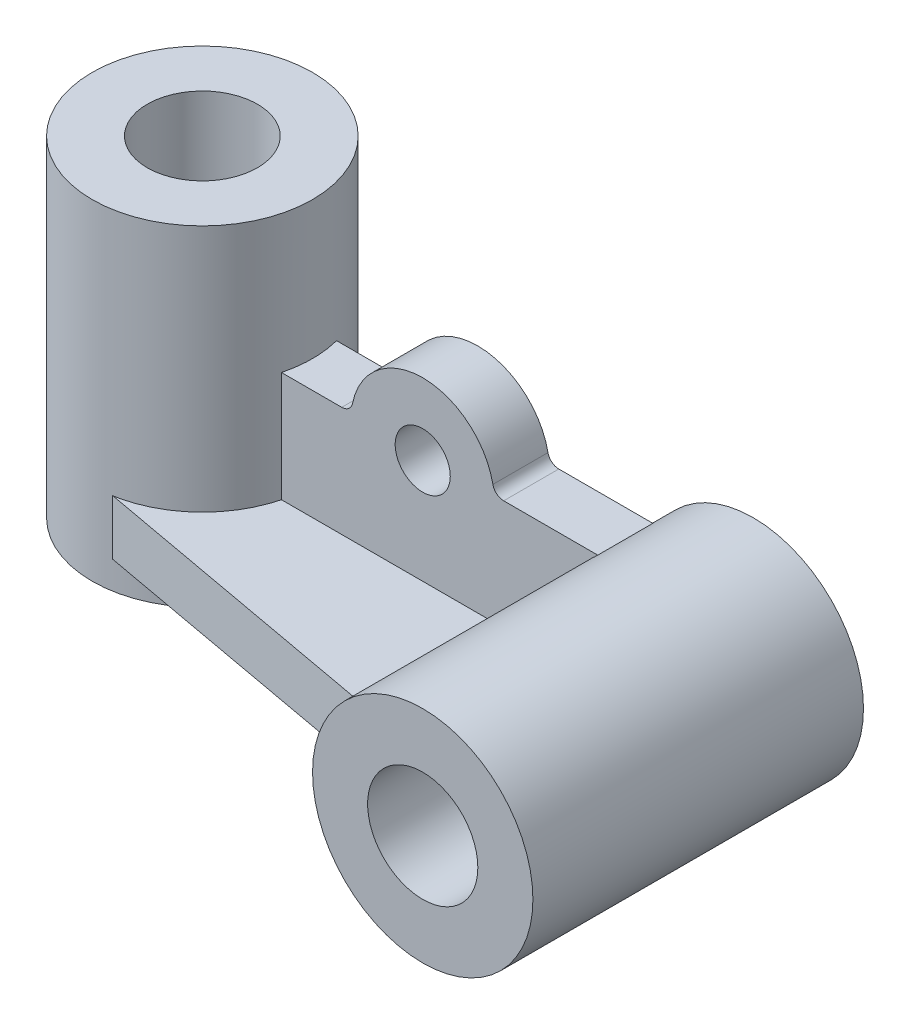
ISO-10303-21;
HEADER;
FILE_DESCRIPTION(('STEP AP214'),'2;1');
FILE_NAME('part.step','',(''),(''),'','','');
FILE_SCHEMA(('AUTOMOTIVE_DESIGN { 1 0 10303 214 1 1 1 1 }'));
ENDSEC;
DATA;
#1=APPLICATION_CONTEXT('core data for automotive mechanical design processes');
#2=APPLICATION_PROTOCOL_DEFINITION('international standard','automotive_design',2000,#1);
#3=PRODUCT_CONTEXT('',#1,'mechanical');
#4=PRODUCT('Part','Part','',(#3));
#5=PRODUCT_RELATED_PRODUCT_CATEGORY('part','',(#4));
#6=PRODUCT_DEFINITION_FORMATION('','',#4);
#7=PRODUCT_DEFINITION_CONTEXT('part definition',#1,'design');
#8=PRODUCT_DEFINITION('design','',#6,#7);
#9=PRODUCT_DEFINITION_SHAPE('','',#8);
#10=(LENGTH_UNIT() NAMED_UNIT(*) SI_UNIT(.MILLI.,.METRE.));
#11=(NAMED_UNIT(*) PLANE_ANGLE_UNIT() SI_UNIT($,.RADIAN.));
#12=(NAMED_UNIT(*) SI_UNIT($,.STERADIAN.) SOLID_ANGLE_UNIT());
#13=UNCERTAINTY_MEASURE_WITH_UNIT(LENGTH_MEASURE(1.E-05),#10,'distance_accuracy_value','');
#14=(GEOMETRIC_REPRESENTATION_CONTEXT(3) GLOBAL_UNCERTAINTY_ASSIGNED_CONTEXT((#13)) GLOBAL_UNIT_ASSIGNED_CONTEXT((#10,
#11,#12)) REPRESENTATION_CONTEXT('',''));
#15=CARTESIAN_POINT('',(0.,0.,0.));
#16=DIRECTION('',(0.,0.,1.));
#17=DIRECTION('',(1.,0.,0.));
#18=AXIS2_PLACEMENT_3D('',#15,#16,#17);
#19=CARTESIAN_POINT('',(76.,-15.,30.));
#20=DIRECTION('',(-1.,0.,0.));
#21=DIRECTION('',(0.,0.,1.));
#22=AXIS2_PLACEMENT_3D('',#19,#20,#21);
#23=PLANE('',#22);
#24=DIRECTION('',(0.,0.,-1.));
#25=VECTOR('',#24,1.);
#26=CARTESIAN_POINT('',(76.,-25.,30.));
#27=LINE('',#26,#25);
#28=CARTESIAN_POINT('',(76.,-25.,30.));
#29=VERTEX_POINT('',#28);
#30=CARTESIAN_POINT('',(76.,-25.,5.));
#31=VERTEX_POINT('',#30);
#32=EDGE_CURVE('E122',#29,#31,#27,.T.);
#33=ORIENTED_EDGE('',*,*,#32,.T.);
#34=DIRECTION('',(0.,-1.,0.));
#35=VECTOR('',#34,1.);
#36=CARTESIAN_POINT('',(76.,-15.,5.));
#37=LINE('',#36,#35);
#38=CARTESIAN_POINT('',(76.,-15.,5.));
#39=VERTEX_POINT('',#38);
#40=EDGE_CURVE('E12',#39,#31,#37,.T.);
#41=ORIENTED_EDGE('',*,*,#40,.F.);
#42=DIRECTION('',(0.,0.,-1.));
#43=VECTOR('',#42,1.);
#44=CARTESIAN_POINT('',(76.,-15.,30.));
#45=LINE('',#44,#43);
#46=CARTESIAN_POINT('',(76.,-15.,30.));
#47=VERTEX_POINT('',#46);
#48=EDGE_CURVE('E130',#47,#39,#45,.T.);
#49=ORIENTED_EDGE('',*,*,#48,.F.);
#50=DIRECTION('',(0.,-1.,0.));
#51=VECTOR('',#50,1.);
#52=CARTESIAN_POINT('',(76.,-15.,30.));
#53=LINE('',#52,#51);
#54=EDGE_CURVE('E118',#47,#29,#53,.T.);
#55=ORIENTED_EDGE('',*,*,#54,.T.);
#56=EDGE_LOOP('',(#33,#41,#49,#55));
#57=FACE_BOUND('',#56,.T.);
#58=ADVANCED_FACE('F48',(#57),#23,.F.);
#59=CARTESIAN_POINT('',(11.,-15.,5.));
#60=DIRECTION('',(0.,0.,1.));
#61=DIRECTION('',(1.,0.,0.));
#62=AXIS2_PLACEMENT_3D('',#59,#60,#61);
#63=PLANE('',#62);
#64=DIRECTION('',(-1.,0.,0.));
#65=VECTOR('',#64,1.);
#66=CARTESIAN_POINT('',(11.,-25.,5.));
#67=LINE('',#66,#65);
#68=CARTESIAN_POINT('',(11.,-25.,5.));
#69=VERTEX_POINT('',#68);
#70=EDGE_CURVE('E125',#31,#69,#67,.T.);
#71=ORIENTED_EDGE('',*,*,#70,.T.);
#72=DIRECTION('',(0.,-1.,0.));
#73=VECTOR('',#72,1.);
#74=CARTESIAN_POINT('',(11.,-15.,5.));
#75=LINE('',#74,#73);
#76=CARTESIAN_POINT('',(11.,-15.,5.));
#77=VERTEX_POINT('',#76);
#78=EDGE_CURVE('E56',#77,#69,#75,.T.);
#79=ORIENTED_EDGE('',*,*,#78,.F.);
#80=DIRECTION('',(-1.,0.,0.));
#81=VECTOR('',#80,1.);
#82=CARTESIAN_POINT('',(11.,-15.,5.));
#83=LINE('',#82,#81);
#84=EDGE_CURVE('E98',#39,#77,#83,.T.);
#85=ORIENTED_EDGE('',*,*,#84,.F.);
#86=ORIENTED_EDGE('',*,*,#40,.T.);
#87=EDGE_LOOP('',(#71,#79,#85,#86));
#88=FACE_BOUND('',#87,.T.);
#89=ADVANCED_FACE('F149',(#88),#63,.F.);
#90=CARTESIAN_POINT('',(11.,-15.,5.));
#91=DIRECTION('',(0.654023537515569,0.,0.75647419808981));
#92=DIRECTION('',(0.75647419808981,0.,-0.654023537515569));
#93=AXIS2_PLACEMENT_3D('',#90,#91,#92);
#94=PLANE('',#93);
#95=DIRECTION('',(-0.75647419808981,0.,0.654023537515569));
#96=VECTOR('',#95,1.);
#97=CARTESIAN_POINT('',(11.,-25.,5.));
#98=LINE('',#97,#96);
#99=CARTESIAN_POINT('',(-4.33929601196317,-25.,18.2618675773414));
#100=VERTEX_POINT('',#99);
#101=EDGE_CURVE('E113',#69,#100,#98,.T.);
#102=ORIENTED_EDGE('',*,*,#101,.T.);
#103=DIRECTION('',(0.,-1.,0.));
#104=VECTOR('',#103,1.);
#105=CARTESIAN_POINT('',(-4.33929601196317,-15.,18.2618675773414));
#106=LINE('',#105,#104);
#107=CARTESIAN_POINT('',(-4.33929601196317,-15.,18.2618675773414));
#108=VERTEX_POINT('',#107);
#109=EDGE_CURVE('E110',#108,#100,#106,.T.);
#110=ORIENTED_EDGE('',*,*,#109,.F.);
#111=DIRECTION('',(-0.75647419808981,0.,0.654023537515569));
#112=VECTOR('',#111,1.);
#113=CARTESIAN_POINT('',(11.,-15.,5.));
#114=LINE('',#113,#112);
#115=EDGE_CURVE('E102',#77,#108,#114,.T.);
#116=ORIENTED_EDGE('',*,*,#115,.F.);
#117=ORIENTED_EDGE('',*,*,#78,.T.);
#118=EDGE_LOOP('',(#102,#110,#116,#117));
#119=FACE_BOUND('',#118,.T.);
#120=ADVANCED_FACE('F111',(#119),#94,.F.);
#121=CARTESIAN_POINT('',(-4.33929601196317,-15.,18.2618675773414));
#122=DIRECTION('',(0.179478606322818,0.,-0.983761876610605));
#123=DIRECTION('',(-0.983761876610605,0.,-0.179478606322818));
#124=AXIS2_PLACEMENT_3D('',#121,#122,#123);
#125=PLANE('',#124);
#126=DIRECTION('',(0.983761876610605,0.,0.179478606322818));
#127=VECTOR('',#126,1.);
#128=CARTESIAN_POINT('',(-4.33929601196317,-25.,18.2618675773414));
#129=LINE('',#128,#127);
#130=CARTESIAN_POINT('',(60.,-25.,30.));
#131=VERTEX_POINT('',#130);
#132=EDGE_CURVE('E84',#100,#131,#129,.T.);
#133=ORIENTED_EDGE('',*,*,#132,.T.);
#134=DIRECTION('',(0.,-1.,0.));
#135=VECTOR('',#134,1.);
#136=CARTESIAN_POINT('',(60.,-15.,30.));
#137=LINE('',#136,#135);
#138=CARTESIAN_POINT('',(60.,-15.,30.));
#139=VERTEX_POINT('',#138);
#140=EDGE_CURVE('E114',#139,#131,#137,.T.);
#141=ORIENTED_EDGE('',*,*,#140,.F.);
#142=DIRECTION('',(0.983761876610605,0.,0.179478606322818));
#143=VECTOR('',#142,1.);
#144=CARTESIAN_POINT('',(-4.33929601196317,-15.,18.2618675773414));
#145=LINE('',#144,#143);
#146=EDGE_CURVE('E106',#108,#139,#145,.T.);
#147=ORIENTED_EDGE('',*,*,#146,.F.);
#148=ORIENTED_EDGE('',*,*,#109,.T.);
#149=EDGE_LOOP('',(#133,#141,#147,#148));
#150=FACE_BOUND('',#149,.T.);
#151=ADVANCED_FACE('F116',(#150),#125,.F.);
#152=CARTESIAN_POINT('',(60.,-15.,30.));
#153=DIRECTION('',(0.,0.,-1.));
#154=DIRECTION('',(-1.,0.,0.));
#155=AXIS2_PLACEMENT_3D('',#152,#153,#154);
#156=PLANE('',#155);
#157=DIRECTION('',(1.,0.,0.));
#158=VECTOR('',#157,1.);
#159=CARTESIAN_POINT('',(60.,-25.,30.));
#160=LINE('',#159,#158);
#161=EDGE_CURVE('E90',#131,#29,#160,.T.);
#162=ORIENTED_EDGE('',*,*,#161,.T.);
#163=ORIENTED_EDGE('',*,*,#54,.F.);
#164=DIRECTION('',(1.,0.,0.));
#165=VECTOR('',#164,1.);
#166=CARTESIAN_POINT('',(60.,-15.,30.));
#167=LINE('',#166,#165);
#168=EDGE_CURVE('E64',#139,#47,#167,.T.);
#169=ORIENTED_EDGE('',*,*,#168,.F.);
#170=ORIENTED_EDGE('',*,*,#140,.T.);
#171=EDGE_LOOP('',(#162,#163,#169,#170));
#172=FACE_BOUND('',#171,.T.);
#173=ADVANCED_FACE('F138',(#172),#156,.F.);
#174=CARTESIAN_POINT('',(0.,-15.,0.));
#175=DIRECTION('',(0.,-1.,0.));
#176=DIRECTION('',(0.,0.,-1.));
#177=AXIS2_PLACEMENT_3D('',#174,#175,#176);
#178=PLANE('',#177);
#179=ORIENTED_EDGE('',*,*,#48,.T.);
#180=ORIENTED_EDGE('',*,*,#84,.T.);
#181=ORIENTED_EDGE('',*,*,#115,.T.);
#182=ORIENTED_EDGE('',*,*,#146,.T.);
#183=ORIENTED_EDGE('',*,*,#168,.T.);
#184=EDGE_LOOP('',(#179,#180,#181,#182,#183));
#185=FACE_BOUND('',#184,.T.);
#186=ADVANCED_FACE('F104',(#185),#178,.F.);
#187=CARTESIAN_POINT('',(0.,-25.,0.));
#188=DIRECTION('',(0.,-1.,0.));
#189=DIRECTION('',(0.,0.,-1.));
#190=AXIS2_PLACEMENT_3D('',#187,#188,#189);
#191=PLANE('',#190);
#192=ORIENTED_EDGE('',*,*,#32,.F.);
#193=ORIENTED_EDGE('',*,*,#161,.F.);
#194=ORIENTED_EDGE('',*,*,#132,.F.);
#195=ORIENTED_EDGE('',*,*,#101,.F.);
#196=ORIENTED_EDGE('',*,*,#70,.F.);
#197=EDGE_LOOP('',(#192,#193,#194,#195,#196));
#198=FACE_BOUND('',#197,.T.);
#199=ADVANCED_FACE('F134',(#198),#191,.T.);
#200=CLOSED_SHELL('',(#58,#89,#120,#151,#173,#186,#199));
#201=MANIFOLD_SOLID_BREP('B2',#200);
#202=CARTESIAN_POINT('',(90.0000000000001,-10.,5.));
#203=DIRECTION('',(0.,0.,-1.));
#204=DIRECTION('',(-1.,0.,0.));
#205=AXIS2_PLACEMENT_3D('',#202,#203,#204);
#206=PLANE('',#205);
#207=CARTESIAN_POINT('',(45.,4.,5.));
#208=DIRECTION('',(0.,0.,1.));
#209=DIRECTION('',(1.,0.,0.));
#210=AXIS2_PLACEMENT_3D('',#207,#208,#209);
#211=CIRCLE('',#210,5.);
#212=CARTESIAN_POINT('',(50.,4.,5.));
#213=VERTEX_POINT('',#212);
#214=EDGE_CURVE('E296',#213,#213,#211,.T.);
#215=ORIENTED_EDGE('',*,*,#214,.F.);
#216=EDGE_LOOP('',(#215));
#217=FACE_BOUND('',#216,.T.);
#218=DIRECTION('',(0.,-1.,0.));
#219=VECTOR('',#218,1.);
#220=CARTESIAN_POINT('',(19.3649167310371,30.,5.));
#221=LINE('',#220,#219);
#222=CARTESIAN_POINT('',(19.3649167310371,-15.,5.));
#223=VERTEX_POINT('',#222);
#224=CARTESIAN_POINT('',(19.3649167310371,5.,5.));
#225=VERTEX_POINT('',#224);
#226=EDGE_CURVE('E220',#223,#225,#221,.F.);
#227=ORIENTED_EDGE('',*,*,#226,.F.);
#228=DIRECTION('',(1.,0.,0.));
#229=VECTOR('',#228,1.);
#230=CARTESIAN_POINT('',(10.,-15.,5.));
#231=LINE('',#230,#229);
#232=CARTESIAN_POINT('',(70.6350832689629,-15.,5.));
#233=VERTEX_POINT('',#232);
#234=EDGE_CURVE('E279',#223,#233,#231,.T.);
#235=ORIENTED_EDGE('',*,*,#234,.T.);
#236=CARTESIAN_POINT('',(90.0000000000001,-10.,5.));
#237=DIRECTION('',(0.,0.,-1.));
#238=DIRECTION('',(-1.,0.,0.));
#239=AXIS2_PLACEMENT_3D('',#236,#237,#238);
#240=CIRCLE('',#239,20.);
#241=CARTESIAN_POINT('',(76.7712434446771,5.,5.));
#242=VERTEX_POINT('',#241);
#243=EDGE_CURVE('E302',#233,#242,#240,.T.);
#244=ORIENTED_EDGE('',*,*,#243,.T.);
#245=DIRECTION('',(-1.,0.,0.));
#246=VECTOR('',#245,1.);
#247=CARTESIAN_POINT('',(59.6969384566991,5.,5.));
#248=LINE('',#247,#246);
#249=CARTESIAN_POINT('',(59.6969384566991,5.,5.));
#250=VERTEX_POINT('',#249);
#251=EDGE_CURVE('E304',#242,#250,#248,.T.);
#252=ORIENTED_EDGE('',*,*,#251,.T.);
#253=CARTESIAN_POINT('',(59.6969384566991,7.,5.));
#254=DIRECTION('',(0.,0.,-1.));
#255=DIRECTION('',(-1.,0.,0.));
#256=AXIS2_PLACEMENT_3D('',#253,#254,#255);
#257=CIRCLE('',#256,2.);
#258=CARTESIAN_POINT('',(57.7373466624725,6.6,5.));
#259=VERTEX_POINT('',#258);
#260=EDGE_CURVE('E306',#250,#259,#257,.T.);
#261=ORIENTED_EDGE('',*,*,#260,.T.);
#262=CARTESIAN_POINT('',(45.,4.,5.));
#263=DIRECTION('',(0.,0.,1.));
#264=DIRECTION('',(-1.,0.,0.));
#265=AXIS2_PLACEMENT_3D('',#262,#263,#264);
#266=CIRCLE('',#265,13.);
#267=CARTESIAN_POINT('',(32.2626533375275,6.6,5.));
#268=VERTEX_POINT('',#267);
#269=EDGE_CURVE('E308',#259,#268,#266,.T.);
#270=ORIENTED_EDGE('',*,*,#269,.T.);
#271=CARTESIAN_POINT('',(30.303061543301,7.,5.));
#272=DIRECTION('',(0.,0.,-1.));
#273=DIRECTION('',(1.,0.,0.));
#274=AXIS2_PLACEMENT_3D('',#271,#272,#273);
#275=CIRCLE('',#274,2.);
#276=CARTESIAN_POINT('',(30.303061543301,5.,5.));
#277=VERTEX_POINT('',#276);
#278=EDGE_CURVE('E310',#268,#277,#275,.T.);
#279=ORIENTED_EDGE('',*,*,#278,.T.);
#280=DIRECTION('',(-1.,0.,0.));
#281=VECTOR('',#280,1.);
#282=CARTESIAN_POINT('',(10.,5.,5.));
#283=LINE('',#282,#281);
#284=EDGE_CURVE('E312',#277,#225,#283,.T.);
#285=ORIENTED_EDGE('',*,*,#284,.T.);
#286=EDGE_LOOP('',(#227,#235,#244,#252,#261,#270,#279,#285));
#287=FACE_BOUND('',#286,.T.);
#288=ADVANCED_FACE('F205',(#217,#287),#206,.F.);
#289=CARTESIAN_POINT('',(90.0000000000001,-10.,-5.));
#290=DIRECTION('',(0.,0.,-1.));
#291=DIRECTION('',(-1.,0.,0.));
#292=AXIS2_PLACEMENT_3D('',#289,#290,#291);
#293=PLANE('',#292);
#294=CARTESIAN_POINT('',(45.,4.,-5.));
#295=DIRECTION('',(0.,0.,1.));
#296=DIRECTION('',(1.,0.,0.));
#297=AXIS2_PLACEMENT_3D('',#294,#295,#296);
#298=CIRCLE('',#297,5.);
#299=CARTESIAN_POINT('',(50.,4.,-5.));
#300=VERTEX_POINT('',#299);
#301=EDGE_CURVE('E292',#300,#300,#298,.T.);
#302=ORIENTED_EDGE('',*,*,#301,.T.);
#303=EDGE_LOOP('',(#302));
#304=FACE_BOUND('',#303,.T.);
#305=DIRECTION('',(1.,0.,0.));
#306=VECTOR('',#305,1.);
#307=CARTESIAN_POINT('',(10.,-15.,-5.));
#308=LINE('',#307,#306);
#309=CARTESIAN_POINT('',(19.3649167310371,-15.,-5.));
#310=VERTEX_POINT('',#309);
#311=CARTESIAN_POINT('',(70.6350832689629,-15.,-5.));
#312=VERTEX_POINT('',#311);
#313=EDGE_CURVE('E286',#310,#312,#308,.T.);
#314=ORIENTED_EDGE('',*,*,#313,.F.);
#315=DIRECTION('',(0.,-1.,0.));
#316=VECTOR('',#315,1.);
#317=CARTESIAN_POINT('',(19.3649167310371,30.,-5.));
#318=LINE('',#317,#316);
#319=CARTESIAN_POINT('',(19.3649167310371,5.,-5.));
#320=VERTEX_POINT('',#319);
#321=EDGE_CURVE('E283',#310,#320,#318,.F.);
#322=ORIENTED_EDGE('',*,*,#321,.T.);
#323=DIRECTION('',(-1.,0.,0.));
#324=VECTOR('',#323,1.);
#325=CARTESIAN_POINT('',(10.,5.,-5.));
#326=LINE('',#325,#324);
#327=CARTESIAN_POINT('',(30.303061543301,5.,-5.));
#328=VERTEX_POINT('',#327);
#329=EDGE_CURVE('E271',#328,#320,#326,.T.);
#330=ORIENTED_EDGE('',*,*,#329,.F.);
#331=CARTESIAN_POINT('',(30.303061543301,7.,-5.));
#332=DIRECTION('',(0.,0.,-1.));
#333=DIRECTION('',(1.,0.,0.));
#334=AXIS2_PLACEMENT_3D('',#331,#332,#333);
#335=CIRCLE('',#334,2.);
#336=CARTESIAN_POINT('',(32.2626533375275,6.6,-5.));
#337=VERTEX_POINT('',#336);
#338=EDGE_CURVE('E280',#337,#328,#335,.T.);
#339=ORIENTED_EDGE('',*,*,#338,.F.);
#340=CARTESIAN_POINT('',(45.,4.,-5.));
#341=DIRECTION('',(0.,0.,1.));
#342=DIRECTION('',(-1.,0.,0.));
#343=AXIS2_PLACEMENT_3D('',#340,#341,#342);
#344=CIRCLE('',#343,13.);
#345=CARTESIAN_POINT('',(57.7373466624725,6.6,-5.));
#346=VERTEX_POINT('',#345);
#347=EDGE_CURVE('E321',#346,#337,#344,.T.);
#348=ORIENTED_EDGE('',*,*,#347,.F.);
#349=CARTESIAN_POINT('',(59.6969384566991,7.,-5.));
#350=DIRECTION('',(0.,0.,-1.));
#351=DIRECTION('',(-1.,0.,0.));
#352=AXIS2_PLACEMENT_3D('',#349,#350,#351);
#353=CIRCLE('',#352,2.);
#354=CARTESIAN_POINT('',(59.6969384566991,5.,-5.));
#355=VERTEX_POINT('',#354);
#356=EDGE_CURVE('E319',#355,#346,#353,.T.);
#357=ORIENTED_EDGE('',*,*,#356,.F.);
#358=DIRECTION('',(-1.,0.,0.));
#359=VECTOR('',#358,1.);
#360=CARTESIAN_POINT('',(59.6969384566991,5.,-5.));
#361=LINE('',#360,#359);
#362=CARTESIAN_POINT('',(76.7712434446771,5.,-5.));
#363=VERTEX_POINT('',#362);
#364=EDGE_CURVE('E317',#363,#355,#361,.T.);
#365=ORIENTED_EDGE('',*,*,#364,.F.);
#366=CARTESIAN_POINT('',(90.0000000000001,-10.,-5.));
#367=DIRECTION('',(0.,0.,-1.));
#368=DIRECTION('',(-1.,0.,0.));
#369=AXIS2_PLACEMENT_3D('',#366,#367,#368);
#370=CIRCLE('',#369,20.);
#371=EDGE_CURVE('E315',#312,#363,#370,.T.);
#372=ORIENTED_EDGE('',*,*,#371,.F.);
#373=EDGE_LOOP('',(#314,#322,#330,#339,#348,#357,#365,#372));
#374=FACE_BOUND('',#373,.T.);
#375=ADVANCED_FACE('F284',(#304,#374),#293,.T.);
#376=CARTESIAN_POINT('',(10.,-15.,5.));
#377=DIRECTION('',(0.,1.,0.));
#378=DIRECTION('',(0.,0.,1.));
#379=AXIS2_PLACEMENT_3D('',#376,#377,#378);
#380=PLANE('',#379);
#381=CARTESIAN_POINT('',(0.,-15.,0.));
#382=DIRECTION('',(0.,1.,0.));
#383=DIRECTION('',(0.,0.,1.));
#384=AXIS2_PLACEMENT_3D('',#381,#382,#383);
#385=CIRCLE('',#384,20.);
#386=EDGE_CURVE('E227',#310,#223,#385,.F.);
#387=ORIENTED_EDGE('',*,*,#386,.F.);
#388=ORIENTED_EDGE('',*,*,#313,.T.);
#389=DIRECTION('',(0.,0.,-1.));
#390=VECTOR('',#389,1.);
#391=CARTESIAN_POINT('',(70.6350832689629,-15.,5.));
#392=LINE('',#391,#390);
#393=EDGE_CURVE('E213',#233,#312,#392,.T.);
#394=ORIENTED_EDGE('',*,*,#393,.F.);
#395=ORIENTED_EDGE('',*,*,#234,.F.);
#396=EDGE_LOOP('',(#387,#388,#394,#395));
#397=FACE_BOUND('',#396,.T.);
#398=ADVANCED_FACE('F207',(#397),#380,.F.);
#399=CARTESIAN_POINT('',(90.0000000000001,-10.,5.));
#400=DIRECTION('',(0.,0.,-1.));
#401=DIRECTION('',(-1.,0.,0.));
#402=AXIS2_PLACEMENT_3D('',#399,#400,#401);
#403=CYLINDRICAL_SURFACE('',#402,20.);
#404=ORIENTED_EDGE('',*,*,#371,.T.);
#405=DIRECTION('',(0.,0.,-1.));
#406=VECTOR('',#405,1.);
#407=CARTESIAN_POINT('',(76.7712434446771,5.,5.));
#408=LINE('',#407,#406);
#409=EDGE_CURVE('E334',#242,#363,#408,.T.);
#410=ORIENTED_EDGE('',*,*,#409,.F.);
#411=ORIENTED_EDGE('',*,*,#243,.F.);
#412=ORIENTED_EDGE('',*,*,#393,.T.);
#413=EDGE_LOOP('',(#404,#410,#411,#412));
#414=FACE_BOUND('',#413,.T.);
#415=ADVANCED_FACE('F340',(#414),#403,.F.);
#416=CARTESIAN_POINT('',(59.6969384566991,5.,5.));
#417=DIRECTION('',(0.,-1.,0.));
#418=DIRECTION('',(0.,0.,-1.));
#419=AXIS2_PLACEMENT_3D('',#416,#417,#418);
#420=PLANE('',#419);
#421=ORIENTED_EDGE('',*,*,#364,.T.);
#422=DIRECTION('',(0.,0.,-1.));
#423=VECTOR('',#422,1.);
#424=CARTESIAN_POINT('',(59.6969384566991,5.,5.));
#425=LINE('',#424,#423);
#426=EDGE_CURVE('E331',#250,#355,#425,.T.);
#427=ORIENTED_EDGE('',*,*,#426,.F.);
#428=ORIENTED_EDGE('',*,*,#251,.F.);
#429=ORIENTED_EDGE('',*,*,#409,.T.);
#430=EDGE_LOOP('',(#421,#427,#428,#429));
#431=FACE_BOUND('',#430,.T.);
#432=ADVANCED_FACE('F347',(#431),#420,.F.);
#433=CARTESIAN_POINT('',(59.6969384566991,7.,5.));
#434=DIRECTION('',(0.,0.,-1.));
#435=DIRECTION('',(-1.,0.,0.));
#436=AXIS2_PLACEMENT_3D('',#433,#434,#435);
#437=CYLINDRICAL_SURFACE('',#436,2.);
#438=ORIENTED_EDGE('',*,*,#356,.T.);
#439=DIRECTION('',(0.,0.,-1.));
#440=VECTOR('',#439,1.);
#441=CARTESIAN_POINT('',(57.7373466624725,6.6,5.));
#442=LINE('',#441,#440);
#443=EDGE_CURVE('E328',#259,#346,#442,.T.);
#444=ORIENTED_EDGE('',*,*,#443,.F.);
#445=ORIENTED_EDGE('',*,*,#260,.F.);
#446=ORIENTED_EDGE('',*,*,#426,.T.);
#447=EDGE_LOOP('',(#438,#444,#445,#446));
#448=FACE_BOUND('',#447,.T.);
#449=ADVANCED_FACE('F351',(#448),#437,.F.);
#450=CARTESIAN_POINT('',(45.,4.,5.));
#451=DIRECTION('',(0.,0.,-1.));
#452=DIRECTION('',(-1.,0.,0.));
#453=AXIS2_PLACEMENT_3D('',#450,#451,#452);
#454=CYLINDRICAL_SURFACE('',#453,13.);
#455=ORIENTED_EDGE('',*,*,#347,.T.);
#456=DIRECTION('',(0.,0.,-1.));
#457=VECTOR('',#456,1.);
#458=CARTESIAN_POINT('',(32.2626533375275,6.6,5.));
#459=LINE('',#458,#457);
#460=EDGE_CURVE('E325',#268,#337,#459,.T.);
#461=ORIENTED_EDGE('',*,*,#460,.F.);
#462=ORIENTED_EDGE('',*,*,#269,.F.);
#463=ORIENTED_EDGE('',*,*,#443,.T.);
#464=EDGE_LOOP('',(#455,#461,#462,#463));
#465=FACE_BOUND('',#464,.T.);
#466=ADVANCED_FACE('F377',(#465),#454,.T.);
#467=CARTESIAN_POINT('',(30.303061543301,7.,5.));
#468=DIRECTION('',(0.,0.,-1.));
#469=DIRECTION('',(-1.,0.,0.));
#470=AXIS2_PLACEMENT_3D('',#467,#468,#469);
#471=CYLINDRICAL_SURFACE('',#470,2.);
#472=ORIENTED_EDGE('',*,*,#338,.T.);
#473=DIRECTION('',(0.,0.,-1.));
#474=VECTOR('',#473,1.);
#475=CARTESIAN_POINT('',(30.303061543301,5.,5.));
#476=LINE('',#475,#474);
#477=EDGE_CURVE('E276',#277,#328,#476,.T.);
#478=ORIENTED_EDGE('',*,*,#477,.F.);
#479=ORIENTED_EDGE('',*,*,#278,.F.);
#480=ORIENTED_EDGE('',*,*,#460,.T.);
#481=EDGE_LOOP('',(#472,#478,#479,#480));
#482=FACE_BOUND('',#481,.T.);
#483=ADVANCED_FACE('F374',(#482),#471,.F.);
#484=CARTESIAN_POINT('',(10.,5.,5.));
#485=DIRECTION('',(0.,-1.,0.));
#486=DIRECTION('',(0.,0.,-1.));
#487=AXIS2_PLACEMENT_3D('',#484,#485,#486);
#488=PLANE('',#487);
#489=CARTESIAN_POINT('',(0.,5.,0.));
#490=DIRECTION('',(0.,-1.,0.));
#491=DIRECTION('',(0.,0.,-1.));
#492=AXIS2_PLACEMENT_3D('',#489,#490,#491);
#493=CIRCLE('',#492,20.);
#494=EDGE_CURVE('E46',#225,#320,#493,.F.);
#495=ORIENTED_EDGE('',*,*,#494,.F.);
#496=ORIENTED_EDGE('',*,*,#284,.F.);
#497=ORIENTED_EDGE('',*,*,#477,.T.);
#498=ORIENTED_EDGE('',*,*,#329,.T.);
#499=EDGE_LOOP('',(#495,#496,#497,#498));
#500=FACE_BOUND('',#499,.T.);
#501=ADVANCED_FACE('F273',(#500),#488,.F.);
#502=CARTESIAN_POINT('',(45.,4.,5.));
#503=DIRECTION('',(0.,0.,-1.));
#504=DIRECTION('',(-1.,0.,0.));
#505=AXIS2_PLACEMENT_3D('',#502,#503,#504);
#506=CYLINDRICAL_SURFACE('',#505,5.);
#507=ORIENTED_EDGE('',*,*,#214,.T.);
#508=EDGE_LOOP('',(#507));
#509=FACE_BOUND('',#508,.T.);
#510=ORIENTED_EDGE('',*,*,#301,.F.);
#511=EDGE_LOOP('',(#510));
#512=FACE_BOUND('',#511,.T.);
#513=ADVANCED_FACE('F369',(#509,#512),#506,.F.);
#514=CARTESIAN_POINT('',(0.,30.,0.));
#515=DIRECTION('',(0.,-1.,0.));
#516=DIRECTION('',(0.,0.,-1.));
#517=AXIS2_PLACEMENT_3D('',#514,#515,#516);
#518=CYLINDRICAL_SURFACE('',#517,20.);
#519=CARTESIAN_POINT('',(0.,30.,0.));
#520=DIRECTION('',(0.,1.,0.));
#521=DIRECTION('',(0.,0.,1.));
#522=AXIS2_PLACEMENT_3D('',#519,#520,#521);
#523=CIRCLE('',#522,20.);
#524=CARTESIAN_POINT('',(0.,30.,20.));
#525=VERTEX_POINT('',#524);
#526=EDGE_CURVE('E288',#525,#525,#523,.T.);
#527=ORIENTED_EDGE('',*,*,#526,.F.);
#528=EDGE_LOOP('',(#527));
#529=FACE_BOUND('',#528,.T.);
#530=CARTESIAN_POINT('',(0.,-30.,0.));
#531=DIRECTION('',(0.,1.,0.));
#532=DIRECTION('',(0.,0.,1.));
#533=AXIS2_PLACEMENT_3D('',#530,#531,#532);
#534=CIRCLE('',#533,20.);
#535=CARTESIAN_POINT('',(0.,-30.,20.));
#536=VERTEX_POINT('',#535);
#537=EDGE_CURVE('E490',#536,#536,#534,.T.);
#538=ORIENTED_EDGE('',*,*,#537,.T.);
#539=EDGE_LOOP('',(#538));
#540=FACE_BOUND('',#539,.T.);
#541=ORIENTED_EDGE('',*,*,#321,.F.);
#542=ORIENTED_EDGE('',*,*,#386,.T.);
#543=ORIENTED_EDGE('',*,*,#226,.T.);
#544=ORIENTED_EDGE('',*,*,#494,.T.);
#545=EDGE_LOOP('',(#541,#542,#543,#544));
#546=FACE_BOUND('',#545,.T.);
#547=ADVANCED_FACE('F290',(#529,#540,#546),#518,.T.);
#548=CARTESIAN_POINT('',(0.,30.,0.));
#549=DIRECTION('',(0.,1.,0.));
#550=DIRECTION('',(0.,0.,1.));
#551=AXIS2_PLACEMENT_3D('',#548,#549,#550);
#552=PLANE('',#551);
#553=ORIENTED_EDGE('',*,*,#526,.T.);
#554=EDGE_LOOP('',(#553));
#555=FACE_BOUND('',#554,.T.);
#556=CARTESIAN_POINT('',(0.,30.,0.));
#557=DIRECTION('',(0.,1.,0.));
#558=DIRECTION('',(0.,0.,1.));
#559=AXIS2_PLACEMENT_3D('',#556,#557,#558);
#560=CIRCLE('',#559,10.);
#561=CARTESIAN_POINT('',(0.,30.,10.));
#562=VERTEX_POINT('',#561);
#563=EDGE_CURVE('E484',#562,#562,#560,.T.);
#564=ORIENTED_EDGE('',*,*,#563,.F.);
#565=EDGE_LOOP('',(#564));
#566=FACE_BOUND('',#565,.T.);
#567=ADVANCED_FACE('F417',(#555,#566),#552,.T.);
#568=CARTESIAN_POINT('',(0.,-30.,0.));
#569=DIRECTION('',(0.,1.,0.));
#570=DIRECTION('',(0.,0.,1.));
#571=AXIS2_PLACEMENT_3D('',#568,#569,#570);
#572=PLANE('',#571);
#573=ORIENTED_EDGE('',*,*,#537,.F.);
#574=EDGE_LOOP('',(#573));
#575=FACE_BOUND('',#574,.T.);
#576=CARTESIAN_POINT('',(0.,-30.,0.));
#577=DIRECTION('',(0.,1.,0.));
#578=DIRECTION('',(0.,0.,1.));
#579=AXIS2_PLACEMENT_3D('',#576,#577,#578);
#580=CIRCLE('',#579,10.);
#581=CARTESIAN_POINT('',(0.,-30.,10.));
#582=VERTEX_POINT('',#581);
#583=EDGE_CURVE('E487',#582,#582,#580,.T.);
#584=ORIENTED_EDGE('',*,*,#583,.T.);
#585=EDGE_LOOP('',(#584));
#586=FACE_BOUND('',#585,.T.);
#587=ADVANCED_FACE('F424',(#575,#586),#572,.F.);
#588=CARTESIAN_POINT('',(0.,30.,0.));
#589=DIRECTION('',(0.,-1.,0.));
#590=DIRECTION('',(0.,0.,-1.));
#591=AXIS2_PLACEMENT_3D('',#588,#589,#590);
#592=CYLINDRICAL_SURFACE('',#591,10.);
#593=ORIENTED_EDGE('',*,*,#563,.T.);
#594=EDGE_LOOP('',(#593));
#595=FACE_BOUND('',#594,.T.);
#596=ORIENTED_EDGE('',*,*,#583,.F.);
#597=EDGE_LOOP('',(#596));
#598=FACE_BOUND('',#597,.T.);
#599=ADVANCED_FACE('F432',(#595,#598),#592,.F.);
#600=CLOSED_SHELL('',(#288,#375,#398,#415,#432,#449,#466,#483,#501,#513,#547,#567,#587,#599));
#601=MANIFOLD_SOLID_BREP('B6',#600);
#602=CARTESIAN_POINT('',(90.,-10.,-9.99999999999999));
#603=DIRECTION('',(0.,0.,1.));
#604=DIRECTION('',(1.,0.,0.));
#605=AXIS2_PLACEMENT_3D('',#602,#603,#604);
#606=CYLINDRICAL_SURFACE('',#605,20.);
#607=CARTESIAN_POINT('',(90.,-10.,-9.99999999999999));
#608=DIRECTION('',(0.,0.,1.));
#609=DIRECTION('',(1.,0.,0.));
#610=AXIS2_PLACEMENT_3D('',#607,#608,#609);
#611=CIRCLE('',#610,20.);
#612=CARTESIAN_POINT('',(110.,-10.,-9.99999999999999));
#613=VERTEX_POINT('',#612);
#614=EDGE_CURVE('E204',#613,#613,#611,.T.);
#615=ORIENTED_EDGE('',*,*,#614,.T.);
#616=EDGE_LOOP('',(#615));
#617=FACE_BOUND('',#616,.T.);
#618=CARTESIAN_POINT('',(90.,-10.,50.));
#619=DIRECTION('',(0.,0.,1.));
#620=DIRECTION('',(1.,0.,0.));
#621=AXIS2_PLACEMENT_3D('',#618,#619,#620);
#622=CIRCLE('',#621,20.);
#623=CARTESIAN_POINT('',(110.,-10.,50.));
#624=VERTEX_POINT('',#623);
#625=EDGE_CURVE('E508',#624,#624,#622,.T.);
#626=ORIENTED_EDGE('',*,*,#625,.F.);
#627=EDGE_LOOP('',(#626));
#628=FACE_BOUND('',#627,.T.);
#629=ADVANCED_FACE('F505',(#617,#628),#606,.T.);
#630=CARTESIAN_POINT('',(90.,-10.,-9.99999999999999));
#631=DIRECTION('',(0.,0.,1.));
#632=DIRECTION('',(1.,0.,0.));
#633=AXIS2_PLACEMENT_3D('',#630,#631,#632);
#634=PLANE('',#633);
#635=CARTESIAN_POINT('',(90.,-10.,-9.99999999999999));
#636=DIRECTION('',(0.,0.,1.));
#637=DIRECTION('',(1.,0.,0.));
#638=AXIS2_PLACEMENT_3D('',#635,#636,#637);
#639=CIRCLE('',#638,9.99999999999999);
#640=CARTESIAN_POINT('',(100.,-10.,-9.99999999999999));
#641=VERTEX_POINT('',#640);
#642=EDGE_CURVE('E515',#641,#641,#639,.T.);
#643=ORIENTED_EDGE('',*,*,#642,.T.);
#644=EDGE_LOOP('',(#643));
#645=FACE_BOUND('',#644,.T.);
#646=ORIENTED_EDGE('',*,*,#614,.F.);
#647=EDGE_LOOP('',(#646));
#648=FACE_BOUND('',#647,.T.);
#649=ADVANCED_FACE('F523',(#645,#648),#634,.F.);
#650=CARTESIAN_POINT('',(90.,-10.,50.));
#651=DIRECTION('',(0.,0.,1.));
#652=DIRECTION('',(1.,0.,0.));
#653=AXIS2_PLACEMENT_3D('',#650,#651,#652);
#654=PLANE('',#653);
#655=CARTESIAN_POINT('',(90.,-10.,50.));
#656=DIRECTION('',(0.,0.,1.));
#657=DIRECTION('',(1.,0.,0.));
#658=AXIS2_PLACEMENT_3D('',#655,#656,#657);
#659=CIRCLE('',#658,9.99999999999999);
#660=CARTESIAN_POINT('',(100.,-10.,50.));
#661=VERTEX_POINT('',#660);
#662=EDGE_CURVE('E517',#661,#661,#659,.T.);
#663=ORIENTED_EDGE('',*,*,#662,.F.);
#664=EDGE_LOOP('',(#663));
#665=FACE_BOUND('',#664,.T.);
#666=ORIENTED_EDGE('',*,*,#625,.T.);
#667=EDGE_LOOP('',(#666));
#668=FACE_BOUND('',#667,.T.);
#669=ADVANCED_FACE('F529',(#665,#668),#654,.T.);
#670=CARTESIAN_POINT('',(90.,-10.,-9.99999999999999));
#671=DIRECTION('',(0.,0.,1.));
#672=DIRECTION('',(1.,0.,0.));
#673=AXIS2_PLACEMENT_3D('',#670,#671,#672);
#674=CYLINDRICAL_SURFACE('',#673,9.99999999999999);
#675=ORIENTED_EDGE('',*,*,#642,.F.);
#676=EDGE_LOOP('',(#675));
#677=FACE_BOUND('',#676,.T.);
#678=ORIENTED_EDGE('',*,*,#662,.T.);
#679=EDGE_LOOP('',(#678));
#680=FACE_BOUND('',#679,.T.);
#681=ADVANCED_FACE('F526',(#677,#680),#674,.F.);
#682=CLOSED_SHELL('',(#629,#649,#669,#681));
#683=MANIFOLD_SOLID_BREP('B40',#682);
#684=ADVANCED_BREP_SHAPE_REPRESENTATION('',(#18,#201,#601,#683),#14);
#685=SHAPE_DEFINITION_REPRESENTATION(#9,#684);
ENDSEC;
END-ISO-10303-21;
